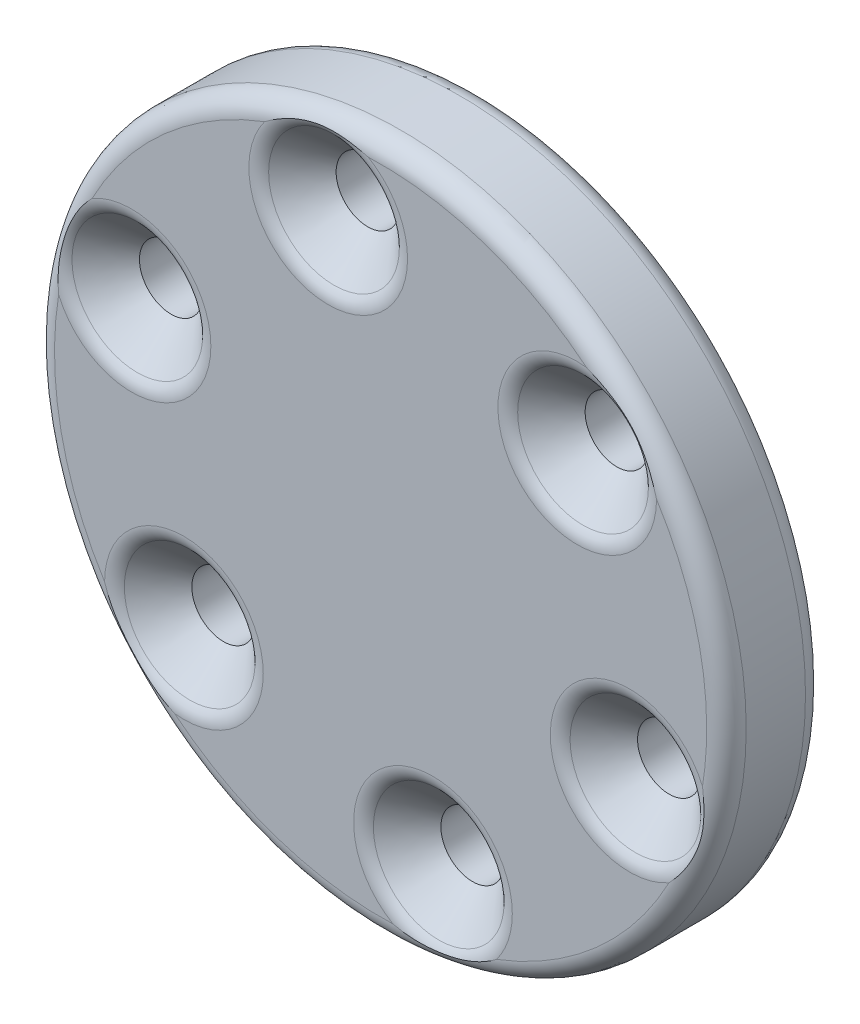
ISO-10303-21;
HEADER;
FILE_DESCRIPTION(('STEP AP214'),'2;1');
FILE_NAME('part.step','',(''),(''),'','','');
FILE_SCHEMA(('AUTOMOTIVE_DESIGN { 1 0 10303 214 1 1 1 1 }'));
ENDSEC;
DATA;
#1=APPLICATION_CONTEXT('core data for automotive mechanical design processes');
#2=APPLICATION_PROTOCOL_DEFINITION('international standard','automotive_design',2000,#1);
#3=PRODUCT_CONTEXT('',#1,'mechanical');
#4=PRODUCT('Part','Part','',(#3));
#5=PRODUCT_RELATED_PRODUCT_CATEGORY('part','',(#4));
#6=PRODUCT_DEFINITION_FORMATION('','',#4);
#7=PRODUCT_DEFINITION_CONTEXT('part definition',#1,'design');
#8=PRODUCT_DEFINITION('design','',#6,#7);
#9=PRODUCT_DEFINITION_SHAPE('','',#8);
#10=(LENGTH_UNIT() NAMED_UNIT(*) SI_UNIT(.MILLI.,.METRE.));
#11=(NAMED_UNIT(*) PLANE_ANGLE_UNIT() SI_UNIT($,.RADIAN.));
#12=(NAMED_UNIT(*) SI_UNIT($,.STERADIAN.) SOLID_ANGLE_UNIT());
#13=UNCERTAINTY_MEASURE_WITH_UNIT(LENGTH_MEASURE(1.E-05),#10,'distance_accuracy_value','');
#14=(GEOMETRIC_REPRESENTATION_CONTEXT(3) GLOBAL_UNCERTAINTY_ASSIGNED_CONTEXT((#13)) GLOBAL_UNIT_ASSIGNED_CONTEXT((#10,
#11,#12)) REPRESENTATION_CONTEXT('',''));
#15=CARTESIAN_POINT('',(0.,0.,0.));
#16=DIRECTION('',(0.,0.,1.));
#17=DIRECTION('',(1.,0.,0.));
#18=AXIS2_PLACEMENT_3D('',#15,#16,#17);
#19=CARTESIAN_POINT('',(-2.65015327966238,13.0205565443838,5.));
#20=DIRECTION('',(0.,0.,-1.));
#21=DIRECTION('',(-1.,0.,0.));
#22=AXIS2_PLACEMENT_3D('',#19,#20,#21);
#23=CYLINDRICAL_SURFACE('',#22,1.6);
#24=CARTESIAN_POINT('',(-2.65015327966238,13.0205565443838,1.));
#25=DIRECTION('',(0.,0.,1.));
#26=DIRECTION('',(1.,0.,0.));
#27=AXIS2_PLACEMENT_3D('',#24,#25,#26);
#28=CIRCLE('',#27,1.6);
#29=CARTESIAN_POINT('',(-1.05015327966238,13.0205565443838,1.));
#30=VERTEX_POINT('',#29);
#31=EDGE_CURVE('E345',#30,#30,#28,.F.);
#32=ORIENTED_EDGE('',*,*,#31,.T.);
#33=EDGE_LOOP('',(#32));
#34=FACE_BOUND('',#33,.T.);
#35=CARTESIAN_POINT('',(-2.65015327966238,13.0205565443838,3.));
#36=DIRECTION('',(0.,0.,1.));
#37=DIRECTION('',(1.,0.,0.));
#38=AXIS2_PLACEMENT_3D('',#35,#36,#37);
#39=CIRCLE('',#38,1.6);
#40=CARTESIAN_POINT('',(-1.05015327966238,13.0205565443838,3.));
#41=VERTEX_POINT('',#40);
#42=EDGE_CURVE('E632',#41,#41,#39,.T.);
#43=ORIENTED_EDGE('',*,*,#42,.T.);
#44=EDGE_LOOP('',(#43));
#45=FACE_BOUND('',#44,.T.);
#46=ADVANCED_FACE('F39',(#34,#45),#23,.F.);
#47=CARTESIAN_POINT('',(9.95105609901738,8.80537833630347,5.));
#48=DIRECTION('',(0.,0.,-1.));
#49=DIRECTION('',(-1.,0.,0.));
#50=AXIS2_PLACEMENT_3D('',#47,#48,#49);
#51=CYLINDRICAL_SURFACE('',#50,1.6);
#52=CARTESIAN_POINT('',(9.95105609901738,8.80537833630347,1.));
#53=DIRECTION('',(0.,0.,1.));
#54=DIRECTION('',(1.,0.,0.));
#55=AXIS2_PLACEMENT_3D('',#52,#53,#54);
#56=CIRCLE('',#55,1.6);
#57=CARTESIAN_POINT('',(11.5510560990174,8.80537833630347,1.));
#58=VERTEX_POINT('',#57);
#59=EDGE_CURVE('E347',#58,#58,#56,.F.);
#60=ORIENTED_EDGE('',*,*,#59,.T.);
#61=EDGE_LOOP('',(#60));
#62=FACE_BOUND('',#61,.T.);
#63=CARTESIAN_POINT('',(9.95105609901738,8.80537833630347,3.));
#64=DIRECTION('',(0.,0.,1.));
#65=DIRECTION('',(1.,0.,0.));
#66=AXIS2_PLACEMENT_3D('',#63,#64,#65);
#67=CIRCLE('',#66,1.6);
#68=CARTESIAN_POINT('',(11.5510560990174,8.80537833630347,3.));
#69=VERTEX_POINT('',#68);
#70=EDGE_CURVE('E634',#69,#69,#67,.T.);
#71=ORIENTED_EDGE('',*,*,#70,.T.);
#72=EDGE_LOOP('',(#71));
#73=FACE_BOUND('',#72,.T.);
#74=ADVANCED_FACE('F237',(#62,#73),#51,.F.);
#75=CARTESIAN_POINT('',(12.6012093786812,-4.21517820808008,5.));
#76=DIRECTION('',(0.,0.,-1.));
#77=DIRECTION('',(-1.,0.,0.));
#78=AXIS2_PLACEMENT_3D('',#75,#76,#77);
#79=CYLINDRICAL_SURFACE('',#78,1.6);
#80=CARTESIAN_POINT('',(12.6012093786812,-4.21517820808008,1.));
#81=DIRECTION('',(0.,0.,1.));
#82=DIRECTION('',(1.,0.,0.));
#83=AXIS2_PLACEMENT_3D('',#80,#81,#82);
#84=CIRCLE('',#83,1.6);
#85=CARTESIAN_POINT('',(14.2012093786812,-4.21517820808008,1.));
#86=VERTEX_POINT('',#85);
#87=EDGE_CURVE('E350',#86,#86,#84,.F.);
#88=ORIENTED_EDGE('',*,*,#87,.T.);
#89=EDGE_LOOP('',(#88));
#90=FACE_BOUND('',#89,.T.);
#91=CARTESIAN_POINT('',(12.6012093786812,-4.21517820808008,3.));
#92=DIRECTION('',(0.,0.,1.));
#93=DIRECTION('',(1.,0.,0.));
#94=AXIS2_PLACEMENT_3D('',#91,#92,#93);
#95=CIRCLE('',#94,1.6);
#96=CARTESIAN_POINT('',(14.2012093786812,-4.21517820808008,3.));
#97=VERTEX_POINT('',#96);
#98=EDGE_CURVE('E367',#97,#97,#95,.T.);
#99=ORIENTED_EDGE('',*,*,#98,.T.);
#100=EDGE_LOOP('',(#99));
#101=FACE_BOUND('',#100,.T.);
#102=ADVANCED_FACE('F243',(#90,#101),#79,.F.);
#103=CARTESIAN_POINT('',(2.65015327966517,-13.0205565443833,5.));
#104=DIRECTION('',(0.,0.,-1.));
#105=DIRECTION('',(-1.,0.,0.));
#106=AXIS2_PLACEMENT_3D('',#103,#104,#105);
#107=CYLINDRICAL_SURFACE('',#106,1.6);
#108=CARTESIAN_POINT('',(2.65015327966517,-13.0205565443833,1.));
#109=DIRECTION('',(0.,0.,1.));
#110=DIRECTION('',(1.,0.,0.));
#111=AXIS2_PLACEMENT_3D('',#108,#109,#110);
#112=CIRCLE('',#111,1.6);
#113=CARTESIAN_POINT('',(4.25015327966517,-13.0205565443833,1.));
#114=VERTEX_POINT('',#113);
#115=EDGE_CURVE('E353',#114,#114,#112,.F.);
#116=ORIENTED_EDGE('',*,*,#115,.T.);
#117=EDGE_LOOP('',(#116));
#118=FACE_BOUND('',#117,.T.);
#119=CARTESIAN_POINT('',(2.65015327966517,-13.0205565443833,3.));
#120=DIRECTION('',(0.,0.,1.));
#121=DIRECTION('',(1.,0.,0.));
#122=AXIS2_PLACEMENT_3D('',#119,#120,#121);
#123=CIRCLE('',#122,1.6);
#124=CARTESIAN_POINT('',(4.25015327966517,-13.0205565443833,3.));
#125=VERTEX_POINT('',#124);
#126=EDGE_CURVE('E361',#125,#125,#123,.T.);
#127=ORIENTED_EDGE('',*,*,#126,.T.);
#128=EDGE_LOOP('',(#127));
#129=FACE_BOUND('',#128,.T.);
#130=ADVANCED_FACE('F254',(#118,#129),#107,.F.);
#131=CARTESIAN_POINT('',(-9.95105609901459,-8.80537833630304,5.));
#132=DIRECTION('',(0.,0.,-1.));
#133=DIRECTION('',(-1.,0.,0.));
#134=AXIS2_PLACEMENT_3D('',#131,#132,#133);
#135=CYLINDRICAL_SURFACE('',#134,1.6);
#136=CARTESIAN_POINT('',(-9.95105609901459,-8.80537833630304,1.));
#137=DIRECTION('',(0.,0.,1.));
#138=DIRECTION('',(1.,0.,0.));
#139=AXIS2_PLACEMENT_3D('',#136,#137,#138);
#140=CIRCLE('',#139,1.6);
#141=CARTESIAN_POINT('',(-8.35105609901459,-8.80537833630304,1.));
#142=VERTEX_POINT('',#141);
#143=EDGE_CURVE('E122',#142,#142,#140,.F.);
#144=ORIENTED_EDGE('',*,*,#143,.T.);
#145=EDGE_LOOP('',(#144));
#146=FACE_BOUND('',#145,.T.);
#147=CARTESIAN_POINT('',(-9.95105609901459,-8.80537833630304,3.));
#148=DIRECTION('',(0.,0.,1.));
#149=DIRECTION('',(1.,0.,0.));
#150=AXIS2_PLACEMENT_3D('',#147,#148,#149);
#151=CIRCLE('',#150,1.6);
#152=CARTESIAN_POINT('',(-8.35105609901459,-8.80537833630304,3.));
#153=VERTEX_POINT('',#152);
#154=EDGE_CURVE('E358',#153,#153,#151,.T.);
#155=ORIENTED_EDGE('',*,*,#154,.T.);
#156=EDGE_LOOP('',(#155));
#157=FACE_BOUND('',#156,.T.);
#158=ADVANCED_FACE('F258',(#146,#157),#135,.F.);
#159=CARTESIAN_POINT('',(-12.6012093786784,4.21517820808051,5.));
#160=DIRECTION('',(0.,0.,-1.));
#161=DIRECTION('',(-1.,0.,0.));
#162=AXIS2_PLACEMENT_3D('',#159,#160,#161);
#163=CYLINDRICAL_SURFACE('',#162,1.6);
#164=CARTESIAN_POINT('',(-12.6012093786784,4.21517820808051,1.));
#165=DIRECTION('',(0.,0.,1.));
#166=DIRECTION('',(1.,0.,0.));
#167=AXIS2_PLACEMENT_3D('',#164,#165,#166);
#168=CIRCLE('',#167,1.6);
#169=CARTESIAN_POINT('',(-11.0012093786784,4.21517820808051,1.));
#170=VERTEX_POINT('',#169);
#171=EDGE_CURVE('E119',#170,#170,#168,.F.);
#172=ORIENTED_EDGE('',*,*,#171,.T.);
#173=EDGE_LOOP('',(#172));
#174=FACE_BOUND('',#173,.T.);
#175=CARTESIAN_POINT('',(-12.6012093786784,4.21517820808051,3.));
#176=DIRECTION('',(0.,0.,1.));
#177=DIRECTION('',(1.,0.,0.));
#178=AXIS2_PLACEMENT_3D('',#175,#176,#177);
#179=CIRCLE('',#178,1.6);
#180=CARTESIAN_POINT('',(-11.0012093786784,4.21517820808051,3.));
#181=VERTEX_POINT('',#180);
#182=EDGE_CURVE('E360',#181,#181,#179,.T.);
#183=ORIENTED_EDGE('',*,*,#182,.T.);
#184=EDGE_LOOP('',(#183));
#185=FACE_BOUND('',#184,.T.);
#186=ADVANCED_FACE('F262',(#174,#185),#163,.F.);
#187=CARTESIAN_POINT('',(0.,0.,5.));
#188=DIRECTION('',(0.,0.,-1.));
#189=DIRECTION('',(-1.,0.,0.));
#190=AXIS2_PLACEMENT_3D('',#187,#188,#189);
#191=CYLINDRICAL_SURFACE('',#190,17.5);
#192=CARTESIAN_POINT('',(0.,0.,1.));
#193=DIRECTION('',(0.,0.,1.));
#194=DIRECTION('',(1.,0.,0.));
#195=AXIS2_PLACEMENT_3D('',#192,#193,#194);
#196=CIRCLE('',#195,17.5);
#197=CARTESIAN_POINT('',(17.5,0.,1.));
#198=VERTEX_POINT('',#197);
#199=EDGE_CURVE('E330',#198,#198,#196,.T.);
#200=ORIENTED_EDGE('',*,*,#199,.T.);
#201=EDGE_LOOP('',(#200));
#202=FACE_BOUND('',#201,.T.);
#203=CARTESIAN_POINT('',(0.,0.,4.));
#204=DIRECTION('',(0.,0.,1.));
#205=DIRECTION('',(1.,0.,0.));
#206=AXIS2_PLACEMENT_3D('',#203,#204,#205);
#207=CIRCLE('',#206,17.5);
#208=CARTESIAN_POINT('',(17.5,0.,4.));
#209=VERTEX_POINT('',#208);
#210=EDGE_CURVE('E364',#209,#209,#207,.F.);
#211=ORIENTED_EDGE('',*,*,#210,.T.);
#212=EDGE_LOOP('',(#211));
#213=FACE_BOUND('',#212,.T.);
#214=ADVANCED_FACE('F249',(#202,#213),#191,.T.);
#215=CARTESIAN_POINT('',(0.,0.,5.));
#216=DIRECTION('',(0.,0.,1.));
#217=DIRECTION('',(1.,0.,0.));
#218=AXIS2_PLACEMENT_3D('',#215,#216,#217);
#219=PLANE('',#218);
#220=CARTESIAN_POINT('',(-9.95105609901459,-8.80537833630304,5.));
#221=DIRECTION('',(0.,0.,1.));
#222=DIRECTION('',(1.,0.,0.));
#223=AXIS2_PLACEMENT_3D('',#220,#221,#222);
#224=CIRCLE('',#223,4.0142135623731);
#225=CARTESIAN_POINT('',(-13.96523039974,-8.78762424561829,5.));
#226=VERTEX_POINT('',#225);
#227=CARTESIAN_POINT('',(-5.93684253664149,-8.80537833630304,5.));
#228=VERTEX_POINT('',#227);
#229=EDGE_CURVE('E65',#226,#228,#224,.F.);
#230=ORIENTED_EDGE('',*,*,#229,.T.);
#231=CARTESIAN_POINT('',(-9.95105609901459,-8.80537833630304,5.));
#232=DIRECTION('',(0.,0.,1.));
#233=DIRECTION('',(1.,0.,0.));
#234=AXIS2_PLACEMENT_3D('',#231,#232,#233);
#235=CIRCLE('',#234,4.0142135623731);
#236=CARTESIAN_POINT('',(-10.4219975750643,-12.7918711119739,5.));
#237=VERTEX_POINT('',#236);
#238=EDGE_CURVE('E60',#228,#237,#235,.F.);
#239=ORIENTED_EDGE('',*,*,#238,.T.);
#240=CARTESIAN_POINT('',(0.,0.,5.));
#241=DIRECTION('',(0.,0.,1.));
#242=DIRECTION('',(1.,0.,0.));
#243=AXIS2_PLACEMENT_3D('',#240,#241,#242);
#244=CIRCLE('',#243,16.5);
#245=CARTESIAN_POINT('',(0.627690635746586,-16.4880564186867,5.));
#246=VERTEX_POINT('',#245);
#247=EDGE_CURVE('E148',#237,#246,#244,.T.);
#248=ORIENTED_EDGE('',*,*,#247,.T.);
#249=CARTESIAN_POINT('',(2.65015327966517,-13.0205565443833,5.));
#250=DIRECTION('',(0.,0.,1.));
#251=DIRECTION('',(1.,0.,0.));
#252=AXIS2_PLACEMENT_3D('',#249,#250,#251);
#253=CIRCLE('',#252,4.0142135623731);
#254=CARTESIAN_POINT('',(6.66436684203827,-13.0205565443833,5.));
#255=VERTEX_POINT('',#254);
#256=EDGE_CURVE('E145',#246,#255,#253,.F.);
#257=ORIENTED_EDGE('',*,*,#256,.T.);
#258=CARTESIAN_POINT('',(2.65015327966517,-13.0205565443833,5.));
#259=DIRECTION('',(0.,0.,1.));
#260=DIRECTION('',(1.,0.,0.));
#261=AXIS2_PLACEMENT_3D('',#258,#259,#260);
#262=CIRCLE('',#261,4.0142135623731);
#263=CARTESIAN_POINT('',(5.86708655737593,-15.4216502141716,5.));
#264=VERTEX_POINT('',#263);
#265=EDGE_CURVE('E143',#255,#264,#262,.F.);
#266=ORIENTED_EDGE('',*,*,#265,.T.);
#267=CARTESIAN_POINT('',(0.,0.,5.));
#268=DIRECTION('',(0.,0.,1.));
#269=DIRECTION('',(1.,0.,0.));
#270=AXIS2_PLACEMENT_3D('',#267,#268,#269);
#271=CIRCLE('',#270,16.5);
#272=CARTESIAN_POINT('',(14.5929210354858,-7.70043217307151,5.));
#273=VERTEX_POINT('',#272);
#274=EDGE_CURVE('E139',#264,#273,#271,.T.);
#275=ORIENTED_EDGE('',*,*,#274,.T.);
#276=CARTESIAN_POINT('',(12.6012093786812,-4.21517820808008,5.));
#277=DIRECTION('',(0.,0.,1.));
#278=DIRECTION('',(1.,0.,0.));
#279=AXIS2_PLACEMENT_3D('',#276,#277,#278);
#280=CIRCLE('',#279,4.0142135623731);
#281=CARTESIAN_POINT('',(16.2890841324384,-2.62977910219536,5.));
#282=VERTEX_POINT('',#281);
#283=EDGE_CURVE('E135',#273,#282,#280,.F.);
#284=ORIENTED_EDGE('',*,*,#283,.T.);
#285=CARTESIAN_POINT('',(0.,0.,5.));
#286=DIRECTION('',(0.,0.,1.));
#287=DIRECTION('',(1.,0.,0.));
#288=AXIS2_PLACEMENT_3D('',#285,#286,#287);
#289=CIRCLE('',#288,16.5);
#290=CARTESIAN_POINT('',(13.9652303997427,8.78762424561389,5.));
#291=VERTEX_POINT('',#290);
#292=EDGE_CURVE('E133',#282,#291,#289,.T.);
#293=ORIENTED_EDGE('',*,*,#292,.T.);
#294=CARTESIAN_POINT('',(9.95105609901738,8.80537833630347,5.));
#295=DIRECTION('',(0.,0.,1.));
#296=DIRECTION('',(1.,0.,0.));
#297=AXIS2_PLACEMENT_3D('',#294,#295,#296);
#298=CIRCLE('',#297,4.0142135623731);
#299=CARTESIAN_POINT('',(10.4219975750632,12.7918711119748,5.));
#300=VERTEX_POINT('',#299);
#301=EDGE_CURVE('E129',#291,#300,#298,.F.);
#302=ORIENTED_EDGE('',*,*,#301,.T.);
#303=CARTESIAN_POINT('',(0.,0.,5.));
#304=DIRECTION('',(0.,0.,1.));
#305=DIRECTION('',(1.,0.,0.));
#306=AXIS2_PLACEMENT_3D('',#303,#304,#305);
#307=CIRCLE('',#306,16.5);
#308=CARTESIAN_POINT('',(-0.627690635743248,16.4880564186868,5.));
#309=VERTEX_POINT('',#308);
#310=EDGE_CURVE('E113',#300,#309,#307,.T.);
#311=ORIENTED_EDGE('',*,*,#310,.T.);
#312=CARTESIAN_POINT('',(-2.65015327966238,13.0205565443838,5.));
#313=DIRECTION('',(0.,0.,1.));
#314=DIRECTION('',(1.,0.,0.));
#315=AXIS2_PLACEMENT_3D('',#312,#313,#314);
#316=CIRCLE('',#315,4.0142135623731);
#317=CARTESIAN_POINT('',(1.36406028271072,13.0205565443838,5.));
#318=VERTEX_POINT('',#317);
#319=EDGE_CURVE('E106',#309,#318,#316,.F.);
#320=ORIENTED_EDGE('',*,*,#319,.T.);
#321=CARTESIAN_POINT('',(-2.65015327966238,13.0205565443838,5.));
#322=DIRECTION('',(0.,0.,1.));
#323=DIRECTION('',(1.,0.,0.));
#324=AXIS2_PLACEMENT_3D('',#321,#322,#323);
#325=CIRCLE('',#324,4.0142135623731);
#326=CARTESIAN_POINT('',(-5.8670865573725,15.4216502141729,5.));
#327=VERTEX_POINT('',#326);
#328=EDGE_CURVE('E110',#318,#327,#325,.F.);
#329=ORIENTED_EDGE('',*,*,#328,.T.);
#330=CARTESIAN_POINT('',(0.,0.,5.));
#331=DIRECTION('',(0.,0.,1.));
#332=DIRECTION('',(1.,0.,0.));
#333=AXIS2_PLACEMENT_3D('',#330,#331,#332);
#334=CIRCLE('',#333,16.5);
#335=CARTESIAN_POINT('',(-14.5929210354867,7.70043217306982,5.));
#336=VERTEX_POINT('',#335);
#337=EDGE_CURVE('E127',#327,#336,#334,.T.);
#338=ORIENTED_EDGE('',*,*,#337,.T.);
#339=CARTESIAN_POINT('',(-12.6012093786784,4.21517820808051,5.));
#340=DIRECTION('',(0.,0.,1.));
#341=DIRECTION('',(1.,0.,0.));
#342=AXIS2_PLACEMENT_3D('',#339,#340,#341);
#343=CIRCLE('',#342,4.0142135623731);
#344=CARTESIAN_POINT('',(-8.58699581630528,4.21517820808051,5.));
#345=VERTEX_POINT('',#344);
#346=EDGE_CURVE('E131',#336,#345,#343,.F.);
#347=ORIENTED_EDGE('',*,*,#346,.T.);
#348=CARTESIAN_POINT('',(-12.6012093786784,4.21517820808051,5.));
#349=DIRECTION('',(0.,0.,1.));
#350=DIRECTION('',(1.,0.,0.));
#351=AXIS2_PLACEMENT_3D('',#348,#349,#350);
#352=CIRCLE('',#351,4.0142135623731);
#353=CARTESIAN_POINT('',(-16.2890841324376,2.62977910220041,5.));
#354=VERTEX_POINT('',#353);
#355=EDGE_CURVE('E137',#345,#354,#352,.F.);
#356=ORIENTED_EDGE('',*,*,#355,.T.);
#357=CARTESIAN_POINT('',(0.,0.,5.));
#358=DIRECTION('',(0.,0.,1.));
#359=DIRECTION('',(1.,0.,0.));
#360=AXIS2_PLACEMENT_3D('',#357,#358,#359);
#361=CIRCLE('',#360,16.5);
#362=EDGE_CURVE('E141',#354,#226,#361,.T.);
#363=ORIENTED_EDGE('',*,*,#362,.T.);
#364=EDGE_LOOP('',(#230,#239,#248,#257,#266,#275,#284,#293,#302,#311,#320,#329,#338,#347,#356,#363));
#365=FACE_BOUND('',#364,.T.);
#366=ADVANCED_FACE('F108',(#365),#219,.T.);
#367=CARTESIAN_POINT('',(0.,0.,0.));
#368=DIRECTION('',(0.,0.,1.));
#369=DIRECTION('',(1.,0.,0.));
#370=AXIS2_PLACEMENT_3D('',#367,#368,#369);
#371=PLANE('',#370);
#372=CARTESIAN_POINT('',(0.,0.,0.));
#373=DIRECTION('',(0.,0.,1.));
#374=DIRECTION('',(1.,0.,0.));
#375=AXIS2_PLACEMENT_3D('',#372,#373,#374);
#376=CIRCLE('',#375,16.5);
#377=CARTESIAN_POINT('',(16.5,0.,0.));
#378=VERTEX_POINT('',#377);
#379=EDGE_CURVE('E342',#378,#378,#376,.F.);
#380=ORIENTED_EDGE('',*,*,#379,.T.);
#381=EDGE_LOOP('',(#380));
#382=FACE_BOUND('',#381,.T.);
#383=CARTESIAN_POINT('',(-2.65015327966238,13.0205565443838,0.));
#384=DIRECTION('',(0.,0.,1.));
#385=DIRECTION('',(1.,0.,0.));
#386=AXIS2_PLACEMENT_3D('',#383,#384,#385);
#387=CIRCLE('',#386,2.6);
#388=CARTESIAN_POINT('',(-0.0501532796623808,13.0205565443838,0.));
#389=VERTEX_POINT('',#388);
#390=EDGE_CURVE('E339',#389,#389,#387,.T.);
#391=ORIENTED_EDGE('',*,*,#390,.T.);
#392=EDGE_LOOP('',(#391));
#393=FACE_BOUND('',#392,.T.);
#394=CARTESIAN_POINT('',(9.95105609901738,8.80537833630347,0.));
#395=DIRECTION('',(0.,0.,1.));
#396=DIRECTION('',(1.,0.,0.));
#397=AXIS2_PLACEMENT_3D('',#394,#395,#396);
#398=CIRCLE('',#397,2.6);
#399=CARTESIAN_POINT('',(12.5510560990174,8.80537833630347,0.));
#400=VERTEX_POINT('',#399);
#401=EDGE_CURVE('E336',#400,#400,#398,.T.);
#402=ORIENTED_EDGE('',*,*,#401,.T.);
#403=EDGE_LOOP('',(#402));
#404=FACE_BOUND('',#403,.T.);
#405=CARTESIAN_POINT('',(12.6012093786812,-4.21517820808008,0.));
#406=DIRECTION('',(0.,0.,1.));
#407=DIRECTION('',(1.,0.,0.));
#408=AXIS2_PLACEMENT_3D('',#405,#406,#407);
#409=CIRCLE('',#408,2.6);
#410=CARTESIAN_POINT('',(15.2012093786812,-4.21517820808008,0.));
#411=VERTEX_POINT('',#410);
#412=EDGE_CURVE('E327',#411,#411,#409,.T.);
#413=ORIENTED_EDGE('',*,*,#412,.T.);
#414=EDGE_LOOP('',(#413));
#415=FACE_BOUND('',#414,.T.);
#416=CARTESIAN_POINT('',(2.65015327966517,-13.0205565443833,0.));
#417=DIRECTION('',(0.,0.,1.));
#418=DIRECTION('',(1.,0.,0.));
#419=AXIS2_PLACEMENT_3D('',#416,#417,#418);
#420=CIRCLE('',#419,2.6);
#421=CARTESIAN_POINT('',(5.25015327966517,-13.0205565443833,0.));
#422=VERTEX_POINT('',#421);
#423=EDGE_CURVE('E323',#422,#422,#420,.T.);
#424=ORIENTED_EDGE('',*,*,#423,.T.);
#425=EDGE_LOOP('',(#424));
#426=FACE_BOUND('',#425,.T.);
#427=CARTESIAN_POINT('',(-9.95105609901459,-8.80537833630304,0.));
#428=DIRECTION('',(0.,0.,1.));
#429=DIRECTION('',(1.,0.,0.));
#430=AXIS2_PLACEMENT_3D('',#427,#428,#429);
#431=CIRCLE('',#430,2.6);
#432=CARTESIAN_POINT('',(-7.35105609901459,-8.80537833630304,0.));
#433=VERTEX_POINT('',#432);
#434=EDGE_CURVE('E321',#433,#433,#431,.T.);
#435=ORIENTED_EDGE('',*,*,#434,.T.);
#436=EDGE_LOOP('',(#435));
#437=FACE_BOUND('',#436,.T.);
#438=CARTESIAN_POINT('',(-12.6012093786784,4.21517820808051,0.));
#439=DIRECTION('',(0.,0.,1.));
#440=DIRECTION('',(1.,0.,0.));
#441=AXIS2_PLACEMENT_3D('',#438,#439,#440);
#442=CIRCLE('',#441,2.6);
#443=CARTESIAN_POINT('',(-10.0012093786784,4.21517820808051,0.));
#444=VERTEX_POINT('',#443);
#445=EDGE_CURVE('E324',#444,#444,#442,.T.);
#446=ORIENTED_EDGE('',*,*,#445,.T.);
#447=EDGE_LOOP('',(#446));
#448=FACE_BOUND('',#447,.T.);
#449=ADVANCED_FACE('F271',(#382,#393,#404,#415,#426,#437,#448),#371,.F.);
#450=CARTESIAN_POINT('',(-2.65015327966238,13.0205565443838,3.));
#451=DIRECTION('',(0.,0.,1.));
#452=DIRECTION('',(1.,0.,0.));
#453=AXIS2_PLACEMENT_3D('',#450,#451,#452);
#454=CONICAL_SURFACE('',#453,1.6,0.785398163397449);
#455=CARTESIAN_POINT('',(-2.65015327966238,13.0205565443838,4.70710678118655));
#456=DIRECTION('',(0.,0.,-1.));
#457=DIRECTION('',(-1.,0.,0.));
#458=AXIS2_PLACEMENT_3D('',#455,#456,#457);
#459=CIRCLE('',#458,3.30710678118655);
#460=CARTESIAN_POINT('',(-5.95726006084894,13.0205565443838,4.70710678118655));
#461=VERTEX_POINT('',#460);
#462=EDGE_CURVE('E11',#461,#461,#459,.F.);
#463=ORIENTED_EDGE('',*,*,#462,.T.);
#464=EDGE_LOOP('',(#463));
#465=FACE_BOUND('',#464,.T.);
#466=ORIENTED_EDGE('',*,*,#42,.F.);
#467=EDGE_LOOP('',(#466));
#468=FACE_BOUND('',#467,.T.);
#469=ADVANCED_FACE('F267',(#465,#468),#454,.F.);
#470=CARTESIAN_POINT('',(9.95105609901738,8.80537833630347,3.));
#471=DIRECTION('',(0.,0.,1.));
#472=DIRECTION('',(1.,0.,0.));
#473=AXIS2_PLACEMENT_3D('',#470,#471,#472);
#474=CONICAL_SURFACE('',#473,1.6,0.785398163397449);
#475=CARTESIAN_POINT('',(9.95105609901738,8.80537833630347,4.70710678118655));
#476=DIRECTION('',(0.,0.,-1.));
#477=DIRECTION('',(-1.,0.,0.));
#478=AXIS2_PLACEMENT_3D('',#475,#476,#477);
#479=CIRCLE('',#478,3.30710678118655);
#480=CARTESIAN_POINT('',(6.64394931783083,8.80537833630347,4.70710678118655));
#481=VERTEX_POINT('',#480);
#482=EDGE_CURVE('E52',#481,#481,#479,.F.);
#483=ORIENTED_EDGE('',*,*,#482,.T.);
#484=EDGE_LOOP('',(#483));
#485=FACE_BOUND('',#484,.T.);
#486=ORIENTED_EDGE('',*,*,#70,.F.);
#487=EDGE_LOOP('',(#486));
#488=FACE_BOUND('',#487,.T.);
#489=ADVANCED_FACE('F270',(#485,#488),#474,.F.);
#490=CARTESIAN_POINT('',(12.6012093786812,-4.21517820808008,3.));
#491=DIRECTION('',(0.,0.,1.));
#492=DIRECTION('',(1.,0.,0.));
#493=AXIS2_PLACEMENT_3D('',#490,#491,#492);
#494=CONICAL_SURFACE('',#493,1.6,0.785398163397448);
#495=CARTESIAN_POINT('',(12.6012093786812,-4.21517820808008,4.70710678118655));
#496=DIRECTION('',(0.,0.,-1.));
#497=DIRECTION('',(-1.,0.,0.));
#498=AXIS2_PLACEMENT_3D('',#495,#496,#497);
#499=CIRCLE('',#498,3.30710678118655);
#500=CARTESIAN_POINT('',(9.29410259749461,-4.21517820808008,4.70710678118655));
#501=VERTEX_POINT('',#500);
#502=EDGE_CURVE('E160',#501,#501,#499,.F.);
#503=ORIENTED_EDGE('',*,*,#502,.T.);
#504=EDGE_LOOP('',(#503));
#505=FACE_BOUND('',#504,.T.);
#506=ORIENTED_EDGE('',*,*,#98,.F.);
#507=EDGE_LOOP('',(#506));
#508=FACE_BOUND('',#507,.T.);
#509=ADVANCED_FACE('F275',(#505,#508),#494,.F.);
#510=CARTESIAN_POINT('',(2.65015327966517,-13.0205565443833,3.));
#511=DIRECTION('',(0.,0.,1.));
#512=DIRECTION('',(1.,0.,0.));
#513=AXIS2_PLACEMENT_3D('',#510,#511,#512);
#514=CONICAL_SURFACE('',#513,1.6,0.785398163397449);
#515=CARTESIAN_POINT('',(2.65015327966517,-13.0205565443833,4.70710678118655));
#516=DIRECTION('',(0.,0.,-1.));
#517=DIRECTION('',(-1.,0.,0.));
#518=AXIS2_PLACEMENT_3D('',#515,#516,#517);
#519=CIRCLE('',#518,3.30710678118655);
#520=CARTESIAN_POINT('',(-0.656953501521382,-13.0205565443833,4.70710678118655));
#521=VERTEX_POINT('',#520);
#522=EDGE_CURVE('E157',#521,#521,#519,.F.);
#523=ORIENTED_EDGE('',*,*,#522,.T.);
#524=EDGE_LOOP('',(#523));
#525=FACE_BOUND('',#524,.T.);
#526=ORIENTED_EDGE('',*,*,#126,.F.);
#527=EDGE_LOOP('',(#526));
#528=FACE_BOUND('',#527,.T.);
#529=ADVANCED_FACE('F279',(#525,#528),#514,.F.);
#530=CARTESIAN_POINT('',(-9.95105609901459,-8.80537833630304,3.));
#531=DIRECTION('',(0.,0.,1.));
#532=DIRECTION('',(1.,0.,0.));
#533=AXIS2_PLACEMENT_3D('',#530,#531,#532);
#534=CONICAL_SURFACE('',#533,1.6,0.785398163397449);
#535=CARTESIAN_POINT('',(-9.95105609901459,-8.80537833630304,4.70710678118655));
#536=DIRECTION('',(0.,0.,-1.));
#537=DIRECTION('',(-1.,0.,0.));
#538=AXIS2_PLACEMENT_3D('',#535,#536,#537);
#539=CIRCLE('',#538,3.30710678118655);
#540=CARTESIAN_POINT('',(-13.2581628802011,-8.80537833630304,4.70710678118655));
#541=VERTEX_POINT('',#540);
#542=EDGE_CURVE('E154',#541,#541,#539,.F.);
#543=ORIENTED_EDGE('',*,*,#542,.T.);
#544=EDGE_LOOP('',(#543));
#545=FACE_BOUND('',#544,.T.);
#546=ORIENTED_EDGE('',*,*,#154,.F.);
#547=EDGE_LOOP('',(#546));
#548=FACE_BOUND('',#547,.T.);
#549=ADVANCED_FACE('F283',(#545,#548),#534,.F.);
#550=CARTESIAN_POINT('',(-12.6012093786784,4.21517820808051,3.));
#551=DIRECTION('',(0.,0.,1.));
#552=DIRECTION('',(1.,0.,0.));
#553=AXIS2_PLACEMENT_3D('',#550,#551,#552);
#554=CONICAL_SURFACE('',#553,1.6,0.785398163397448);
#555=CARTESIAN_POINT('',(-12.6012093786784,4.21517820808051,4.70710678118655));
#556=DIRECTION('',(0.,0.,-1.));
#557=DIRECTION('',(-1.,0.,0.));
#558=AXIS2_PLACEMENT_3D('',#555,#556,#557);
#559=CIRCLE('',#558,3.30710678118655);
#560=CARTESIAN_POINT('',(-15.9083161598649,4.21517820808051,4.70710678118655));
#561=VERTEX_POINT('',#560);
#562=EDGE_CURVE('E151',#561,#561,#559,.F.);
#563=ORIENTED_EDGE('',*,*,#562,.T.);
#564=EDGE_LOOP('',(#563));
#565=FACE_BOUND('',#564,.T.);
#566=ORIENTED_EDGE('',*,*,#182,.F.);
#567=EDGE_LOOP('',(#566));
#568=FACE_BOUND('',#567,.T.);
#569=ADVANCED_FACE('F287',(#565,#568),#554,.F.);
#570=CARTESIAN_POINT('',(0.,0.,1.));
#571=DIRECTION('',(0.,0.,1.));
#572=DIRECTION('',(1.,0.,0.));
#573=AXIS2_PLACEMENT_3D('',#570,#571,#572);
#574=TOROIDAL_SURFACE('',#573,16.5,1.);
#575=ORIENTED_EDGE('',*,*,#379,.F.);
#576=EDGE_LOOP('',(#575));
#577=FACE_BOUND('',#576,.T.);
#578=ORIENTED_EDGE('',*,*,#199,.F.);
#579=EDGE_LOOP('',(#578));
#580=FACE_BOUND('',#579,.T.);
#581=ADVANCED_FACE('F291',(#577,#580),#574,.T.);
#582=CARTESIAN_POINT('',(-2.65015327966238,13.0205565443838,1.));
#583=DIRECTION('',(0.,0.,1.));
#584=DIRECTION('',(1.,0.,0.));
#585=AXIS2_PLACEMENT_3D('',#582,#583,#584);
#586=TOROIDAL_SURFACE('',#585,2.6,1.);
#587=ORIENTED_EDGE('',*,*,#31,.F.);
#588=EDGE_LOOP('',(#587));
#589=FACE_BOUND('',#588,.T.);
#590=ORIENTED_EDGE('',*,*,#390,.F.);
#591=EDGE_LOOP('',(#590));
#592=FACE_BOUND('',#591,.T.);
#593=ADVANCED_FACE('F295',(#589,#592),#586,.T.);
#594=CARTESIAN_POINT('',(9.95105609901738,8.80537833630347,1.));
#595=DIRECTION('',(0.,0.,1.));
#596=DIRECTION('',(1.,0.,0.));
#597=AXIS2_PLACEMENT_3D('',#594,#595,#596);
#598=TOROIDAL_SURFACE('',#597,2.6,1.);
#599=ORIENTED_EDGE('',*,*,#59,.F.);
#600=EDGE_LOOP('',(#599));
#601=FACE_BOUND('',#600,.T.);
#602=ORIENTED_EDGE('',*,*,#401,.F.);
#603=EDGE_LOOP('',(#602));
#604=FACE_BOUND('',#603,.T.);
#605=ADVANCED_FACE('F299',(#601,#604),#598,.T.);
#606=CARTESIAN_POINT('',(12.6012093786812,-4.21517820808008,1.));
#607=DIRECTION('',(0.,0.,1.));
#608=DIRECTION('',(1.,0.,0.));
#609=AXIS2_PLACEMENT_3D('',#606,#607,#608);
#610=TOROIDAL_SURFACE('',#609,2.6,1.);
#611=ORIENTED_EDGE('',*,*,#87,.F.);
#612=EDGE_LOOP('',(#611));
#613=FACE_BOUND('',#612,.T.);
#614=ORIENTED_EDGE('',*,*,#412,.F.);
#615=EDGE_LOOP('',(#614));
#616=FACE_BOUND('',#615,.T.);
#617=ADVANCED_FACE('F303',(#613,#616),#610,.T.);
#618=CARTESIAN_POINT('',(2.65015327966517,-13.0205565443833,1.));
#619=DIRECTION('',(0.,0.,1.));
#620=DIRECTION('',(1.,0.,0.));
#621=AXIS2_PLACEMENT_3D('',#618,#619,#620);
#622=TOROIDAL_SURFACE('',#621,2.6,1.);
#623=ORIENTED_EDGE('',*,*,#115,.F.);
#624=EDGE_LOOP('',(#623));
#625=FACE_BOUND('',#624,.T.);
#626=ORIENTED_EDGE('',*,*,#423,.F.);
#627=EDGE_LOOP('',(#626));
#628=FACE_BOUND('',#627,.T.);
#629=ADVANCED_FACE('F307',(#625,#628),#622,.T.);
#630=CARTESIAN_POINT('',(-9.95105609901459,-8.80537833630304,1.));
#631=DIRECTION('',(0.,0.,1.));
#632=DIRECTION('',(1.,0.,0.));
#633=AXIS2_PLACEMENT_3D('',#630,#631,#632);
#634=TOROIDAL_SURFACE('',#633,2.6,1.);
#635=ORIENTED_EDGE('',*,*,#143,.F.);
#636=EDGE_LOOP('',(#635));
#637=FACE_BOUND('',#636,.T.);
#638=ORIENTED_EDGE('',*,*,#434,.F.);
#639=EDGE_LOOP('',(#638));
#640=FACE_BOUND('',#639,.T.);
#641=ADVANCED_FACE('F233',(#637,#640),#634,.T.);
#642=CARTESIAN_POINT('',(-12.6012093786784,4.21517820808051,1.));
#643=DIRECTION('',(0.,0.,1.));
#644=DIRECTION('',(1.,0.,0.));
#645=AXIS2_PLACEMENT_3D('',#642,#643,#644);
#646=TOROIDAL_SURFACE('',#645,2.6,1.);
#647=ORIENTED_EDGE('',*,*,#171,.F.);
#648=EDGE_LOOP('',(#647));
#649=FACE_BOUND('',#648,.T.);
#650=ORIENTED_EDGE('',*,*,#445,.F.);
#651=EDGE_LOOP('',(#650));
#652=FACE_BOUND('',#651,.T.);
#653=ADVANCED_FACE('F227',(#649,#652),#646,.T.);
#654=CARTESIAN_POINT('',(-2.65015327966238,13.0205565443838,4.));
#655=DIRECTION('',(0.,0.,1.));
#656=DIRECTION('',(1.,0.,0.));
#657=AXIS2_PLACEMENT_3D('',#654,#655,#656);
#658=TOROIDAL_SURFACE('',#657,4.0142135623731,1.);
#659=ORIENTED_EDGE('',*,*,#462,.F.);
#660=EDGE_LOOP('',(#659));
#661=FACE_BOUND('',#660,.T.);
#662=ORIENTED_EDGE('',*,*,#328,.F.);
#663=ORIENTED_EDGE('',*,*,#319,.F.);
#664=CARTESIAN_POINT('',(-0.627690635743256,16.4880564186868,5.00000000000001));
#665=CARTESIAN_POINT('',(-0.630483357944817,16.4887546221146,4.99999999496241));
#666=CARTESIAN_POINT('',(-0.63327655033944,16.4894510345053,4.99999902567045));
#667=CARTESIAN_POINT('',(-0.800381147444526,16.5310001610585,4.99988380228398));
#668=CARTESIAN_POINT('',(-0.966308462622403,16.5656526938622,4.99645991685647));
#669=CARTESIAN_POINT('',(-1.30033406227146,16.6218382926356,4.98593220326691));
#670=CARTESIAN_POINT('',(-1.46843396503105,16.643360925805,4.9788254570352));
#671=CARTESIAN_POINT('',(-1.80616961337385,16.6727578098223,4.96354289300826));
#672=CARTESIAN_POINT('',(-1.97580793864603,16.680601679875,4.95536473876258));
#673=CARTESIAN_POINT('',(-2.31516871677905,16.6821406552161,4.94029466141036));
#674=CARTESIAN_POINT('',(-2.48489113253361,16.6758397413298,4.93340237700742));
#675=CARTESIAN_POINT('',(-2.82369108421707,16.6488397513169,4.92271979455607));
#676=CARTESIAN_POINT('',(-2.99276627055931,16.6281079107728,4.91893659818452));
#677=CARTESIAN_POINT('',(-3.32857877125074,16.5722232353288,4.91550172408997));
#678=CARTESIAN_POINT('',(-3.49531588603569,16.5370691770874,4.9158503969161));
#679=CARTESIAN_POINT('',(-3.8249867128348,16.4526646375878,4.92058614841053));
#680=CARTESIAN_POINT('',(-3.98792314615661,16.4034245993544,4.92497024063101));
#681=CARTESIAN_POINT('',(-4.30889952460265,16.2913863957468,4.93660836512742));
#682=CARTESIAN_POINT('',(-4.46694045104232,16.2285909679565,4.94386181816638));
#683=CARTESIAN_POINT('',(-4.81366672431785,16.0738509864973,4.96111983678677));
#684=CARTESIAN_POINT('',(-5.00083361999336,15.9785242015728,4.97137046114723));
#685=CARTESIAN_POINT('',(-5.36465309715247,15.7698493155111,4.98870104727436));
#686=CARTESIAN_POINT('',(-5.54132167658005,15.6565296538972,4.99578594648221));
#687=CARTESIAN_POINT('',(-5.76202204675476,15.499706997849,4.99948101632031));
#688=CARTESIAN_POINT('',(-5.81135734401293,15.4636121450658,4.99995606091975));
#689=CARTESIAN_POINT('',(-5.86249016770068,15.4251171861677,4.99999903214848));
#690=CARTESIAN_POINT('',(-5.86478886953667,15.4233843040018,5.00000000225762));
#691=CARTESIAN_POINT('',(-5.86708645632085,15.4216499407206,5.00000000193267));
#692=B_SPLINE_CURVE_WITH_KNOTS('',3,(#664,#665,#666,#667,#668,#669,#670,#671,#672,#673,#674,
#675,#676,#677,#678,#679,#680,#681,#682,#683,#684,#685,#686,#687,#688,#689,#690,#691),
.UNSPECIFIED.,.F.,.F.,(4,2,2,2,2,2,2,2,2,2,2,2,2,4),(0.,0.00863609734735337,0.516573866236208,
1.02491471013523,1.53438315765943,2.04370824133685,2.55419350024899,3.06472206920703,
3.57487312048778,4.08492124024323,4.71473802773347,5.34356905958262,5.52694312292643,
5.53557921984481),.UNSPECIFIED.);
#693=EDGE_CURVE('E43',#327,#309,#692,.F.);
#694=ORIENTED_EDGE('',*,*,#693,.F.);
#695=EDGE_LOOP('',(#662,#663,#694));
#696=FACE_BOUND('',#695,.T.);
#697=ADVANCED_FACE('F117',(#661,#696),#658,.T.);
#698=CARTESIAN_POINT('',(-12.6012093786784,4.21517820808051,4.));
#699=DIRECTION('',(0.,0.,1.));
#700=DIRECTION('',(1.,0.,0.));
#701=AXIS2_PLACEMENT_3D('',#698,#699,#700);
#702=TOROIDAL_SURFACE('',#701,4.0142135623731,1.);
#703=ORIENTED_EDGE('',*,*,#562,.F.);
#704=EDGE_LOOP('',(#703));
#705=FACE_BOUND('',#704,.T.);
#706=ORIENTED_EDGE('',*,*,#355,.F.);
#707=ORIENTED_EDGE('',*,*,#346,.F.);
#708=CARTESIAN_POINT('',(-14.5929210354867,7.70043217306984,5.00000000000115));
#709=CARTESIAN_POINT('',(-14.594922058493,7.69836270641145,4.99999999496316));
#710=CARTESIAN_POINT('',(-14.5969217655121,7.6962919370354,4.99999902567082));
#711=CARTESIAN_POINT('',(-14.7164566841242,7.57234965239725,4.99988380224206));
#712=CARTESIAN_POINT('',(-14.8294303347508,7.44597862533008,4.99645991563436));
#713=CARTESIAN_POINT('',(-15.045101326035,7.18479671937753,4.98593219881897));
#714=CARTESIAN_POINT('',(-15.1477904406905,7.04997922255201,4.97882545051499));
#715=CARTESIAN_POINT('',(-15.3421167066848,6.77219000511154,4.96354288555712));
#716=CARTESIAN_POINT('',(-15.4337288413024,6.62920086279223,4.95536473282608));
#717=CARTESIAN_POINT('',(-15.6047419866499,6.33607534589637,4.94029465869716));
#718=CARTESIAN_POINT('',(-15.6841464266787,6.18594099407757,4.93340237596524));
#719=CARTESIAN_POINT('',(-15.8301636685464,5.87903175069431,4.92271979755609));
#720=CARTESIAN_POINT('',(-15.8967469255396,5.72224251404006,4.91893660240909));
#721=CARTESIAN_POINT('',(-16.0162555854526,5.40347819081749,4.91550172551592));
#722=CARTESIAN_POINT('',(-16.0691798280013,5.24150266497256,4.9158503946651));
#723=CARTESIAN_POINT('',(-16.1609187831181,4.91379707104486,4.92058613848084));
#724=CARTESIAN_POINT('',(-16.1997438848167,4.74806986349116,4.92497023113982));
#725=CARTESIAN_POINT('',(-16.2632042581356,4.41407688367928,4.93660835882101));
#726=CARTESIAN_POINT('',(-16.2878423941064,4.24581163089797,4.94386181401924));
#727=CARTESIAN_POINT('',(-16.3271965044886,3.8681677292389,4.96111984318012));
#728=CARTESIAN_POINT('',(-16.3382240309611,3.65841299590811,4.97137047715584));
#729=CARTESIAN_POINT('',(-16.3394173225434,3.23899847972286,4.98870105042528));
#730=CARTESIAN_POINT('',(-16.3296157353056,3.02933906270896,4.99578593066891));
#731=CARTESIAN_POINT('',(-16.3041503105262,2.75979614664356,4.99948102100872));
#732=CARTESIAN_POINT('',(-16.2975578087971,2.69902326199546,4.99995607318756));
#733=CARTESIAN_POINT('',(-16.289788519449,2.63549325144528,4.99999903151246));
#734=CARTESIAN_POINT('',(-16.2894372426434,2.63263606468871,5.00000000099704));
#735=CARTESIAN_POINT('',(-16.2890841324376,2.62977910220039,5.));
#736=B_SPLINE_CURVE_WITH_KNOTS('',3,(#708,#709,#710,#711,#712,#713,#714,#715,#716,#717,#718,
#719,#720,#721,#722,#723,#724,#725,#726,#727,#728,#729,#730,#731,#732,#733,#734,#735),
.UNSPECIFIED.,.F.,.F.,(4,2,2,2,2,2,2,2,2,2,2,2,2,4),(0.,0.00863609734736057,0.51657395681386,
1.02491489495003,1.53438325752952,2.0437082413419,2.55419321351886,3.06472153854406,
3.5748729072971,4.08492124026505,4.71473837503353,5.34356905959991,5.5269430386105,
5.53557913595786),.UNSPECIFIED.);
#737=EDGE_CURVE('E209',#354,#336,#736,.F.);
#738=ORIENTED_EDGE('',*,*,#737,.F.);
#739=EDGE_LOOP('',(#706,#707,#738));
#740=FACE_BOUND('',#739,.T.);
#741=ADVANCED_FACE('F219',(#705,#740),#702,.T.);
#742=CARTESIAN_POINT('',(-9.95105609901459,-8.80537833630304,4.));
#743=DIRECTION('',(0.,0.,1.));
#744=DIRECTION('',(1.,0.,0.));
#745=AXIS2_PLACEMENT_3D('',#742,#743,#744);
#746=TOROIDAL_SURFACE('',#745,4.0142135623731,1.);
#747=ORIENTED_EDGE('',*,*,#542,.F.);
#748=EDGE_LOOP('',(#747));
#749=FACE_BOUND('',#748,.T.);
#750=ORIENTED_EDGE('',*,*,#238,.F.);
#751=ORIENTED_EDGE('',*,*,#229,.F.);
#752=CARTESIAN_POINT('',(-10.4219975750643,-12.7918711119739,5.));
#753=CARTESIAN_POINT('',(-10.4246483122056,-12.7907484464272,4.99999999496241));
#754=CARTESIAN_POINT('',(-10.4272983472624,-12.7896240674125,4.99999902567045));
#755=CARTESIAN_POINT('',(-10.5857697709797,-12.7222661090576,4.99988380226399));
#756=CARTESIAN_POINT('',(-10.7391512733876,-12.6501079706613,4.99645991564026));
#757=CARTESIAN_POINT('',(-11.0397544943844,-12.4940065036458,4.98593219881315));
#758=CARTESIAN_POINT('',(-11.1869712282315,-12.4100538682231,4.97882545051349));
#759=CARTESIAN_POINT('',(-11.4744193221455,-12.2303231243675,4.96354288555878));
#760=CARTESIAN_POINT('',(-11.6146344655554,-12.1345192017492,4.95536473282655));
#761=CARTESIAN_POINT('',(-11.8866188264585,-11.9315596689313,4.94029465869675));
#762=CARTESIAN_POINT('',(-12.0183904097682,-11.8244072610046,4.93340237596512));
#763=CARTESIAN_POINT('',(-12.2727552651525,-11.598990227615,4.92271979755619));
#764=CARTESIAN_POINT('',(-12.3953269501097,-11.480700849862,4.91893660240911));
#765=CARTESIAN_POINT('',(-12.6299260992537,-11.2340102485521,4.91550172551587));
#766=CARTESIAN_POINT('',(-12.7419526670902,-11.1056081671015,4.91585039466507));
#767=CARTESIAN_POINT('',(-12.9544863720449,-10.8398330432925,4.92058613848083));
#768=CARTESIAN_POINT('',(-13.0550019536329,-10.7024666947807,4.9249702311398));
#769=CARTESIAN_POINT('',(-13.2439644741082,-10.41985088595,4.93660835882099));
#770=CARTESIAN_POINT('',(-13.3324138464111,-10.2746030233945,4.94386181401921));
#771=CARTESIAN_POINT('',(-13.5162501911899,-9.94238643620679,4.96111984318011));
#772=CARTESIAN_POINT('',(-13.6083891650314,-9.75362980984831,4.97137047715583));
#773=CARTESIAN_POINT('',(-13.7734279580319,-9.36804952360859,4.98870105042528));
#774=CARTESIAN_POINT('',(-13.8463576844606,-9.17123896175268,4.99578593066891));
#775=CARTESIAN_POINT('',(-13.9282769755968,-8.91318644539211,4.99948102100872));
#776=CARTESIAN_POINT('',(-13.9459638208032,-8.85467166013107,4.99995607318756));
#777=CARTESIAN_POINT('',(-13.9636452046504,-8.79315911862344,4.99999903151246));
#778=CARTESIAN_POINT('',(-13.9644386897953,-8.79039193722697,5.00000000099704));
#779=CARTESIAN_POINT('',(-13.96523039974,-8.78762424561831,5.));
#780=B_SPLINE_CURVE_WITH_KNOTS('',3,(#752,#753,#754,#755,#756,#757,#758,#759,#760,#761,#762,
#763,#764,#765,#766,#767,#768,#769,#770,#771,#772,#773,#774,#775,#776,#777,#778,#779),
.UNSPECIFIED.,.F.,.F.,(4,2,2,2,2,2,2,2,2,2,2,2,2,4),(0.,0.00863609734735624,0.51657395681221,
1.02491489494804,1.53438325752872,2.04370824134177,2.55419321351866,3.06472153854383,
3.57487290729691,4.08492124026492,4.71473837503357,5.34356905960006,5.52694303861071,
5.53557913595806),.UNSPECIFIED.);
#781=EDGE_CURVE('E203',#237,#226,#780,.T.);
#782=ORIENTED_EDGE('',*,*,#781,.F.);
#783=EDGE_LOOP('',(#750,#751,#782));
#784=FACE_BOUND('',#783,.T.);
#785=ADVANCED_FACE('F216',(#749,#784),#746,.T.);
#786=CARTESIAN_POINT('',(2.65015327966517,-13.0205565443833,4.));
#787=DIRECTION('',(0.,0.,1.));
#788=DIRECTION('',(1.,0.,0.));
#789=AXIS2_PLACEMENT_3D('',#786,#787,#788);
#790=TOROIDAL_SURFACE('',#789,4.0142135623731,1.);
#791=ORIENTED_EDGE('',*,*,#522,.F.);
#792=EDGE_LOOP('',(#791));
#793=FACE_BOUND('',#792,.T.);
#794=ORIENTED_EDGE('',*,*,#265,.F.);
#795=ORIENTED_EDGE('',*,*,#256,.F.);
#796=CARTESIAN_POINT('',(5.86708655737593,-15.4216502141716,5.00000000000256));
#797=CARTESIAN_POINT('',(5.86478893192191,-15.4233844871013,4.99999999496409));
#798=CARTESIAN_POINT('',(5.86249017360324,-15.4251172952741,4.99999902567127));
#799=CARTESIAN_POINT('',(5.72492075866088,-15.5286785948101,4.99988380221532));
#800=CARTESIAN_POINT('',(5.5857392265151,-15.6254318031689,4.99645991562715));
#801=CARTESIAN_POINT('',(5.300249780012,-15.8077110955049,4.98593219882602));
#802=CARTESIAN_POINT('',(5.15393629809743,-15.8932282091673,4.97882545051676));
#803=CARTESIAN_POINT('',(4.85456086112076,-16.052300188838,4.963542885555));
#804=CARTESIAN_POINT('',(4.70148465864691,-16.1258281037168,4.95536473282537));
#805=CARTESIAN_POINT('',(4.38972436683602,-16.2598937032815,4.94029465869747));
#806=CARTESIAN_POINT('',(4.23104186784041,-16.320435037961,4.93340237596516));
#807=CARTESIAN_POINT('',(3.9086425627875,-16.428012947859,4.9227197975557));
#808=CARTESIAN_POINT('',(3.74491511417691,-16.4750184519402,4.91893660240878));
#809=CARTESIAN_POINT('',(3.4139752119956,-16.5548419741501,4.91550172551567));
#810=CARTESIAN_POINT('',(3.24676246364226,-16.5876587870701,4.91585039466481));
#811=CARTESIAN_POINT('',(2.9103276022524,-16.6388308128168,4.92058613848053));
#812=CARTESIAN_POINT('',(2.74110706402208,-16.6571966856924,4.92497023113952));
#813=CARTESIAN_POINT('',(2.40187333382603,-16.6795351243718,4.93660835882073));
#814=CARTESIAN_POINT('',(2.23186030885626,-16.6835105964571,4.94386181401897));
#815=CARTESIAN_POINT('',(1.85223413240337,-16.6766092475807,4.96111984317991));
#816=CARTESIAN_POINT('',(1.64269661192316,-16.6620256264268,4.97137047715568));
#817=CARTESIAN_POINT('',(1.22625489234005,-16.6121632706552,4.98870105042521));
#818=CARTESIAN_POINT('',(1.01934708282499,-16.5769169855053,4.99578593066889));
#819=CARTESIAN_POINT('',(0.754907402577592,-16.5188349145089,4.99948102100871));
#820=CARTESIAN_POINT('',(0.695388689441202,-16.50489477914,4.99995607318756));
#821=CARTESIAN_POINT('',(0.63327657392052,-16.4894510359718,4.99999903151246));
#822=CARTESIAN_POINT('',(0.630483381961859,-16.4887546235665,5.00000000099704));
#823=CARTESIAN_POINT('',(0.627690635746588,-16.4880564186867,5.));
#824=B_SPLINE_CURVE_WITH_KNOTS('',3,(#796,#797,#798,#799,#800,#801,#802,#803,#804,#805,#806,
#807,#808,#809,#810,#811,#812,#813,#814,#815,#816,#817,#818,#819,#820,#821,#822,#823),
.UNSPECIFIED.,.F.,.F.,(4,2,2,2,2,2,2,2,2,2,2,2,2,4),(0.,0.00863609734734593,0.516573956816114,
1.02491489495291,1.5343832575311,2.04370824134283,2.5541932135199,3.06472153854514,
3.57487290729813,4.08492124026601,4.71473837503575,5.34356905960355,5.52694303861459,
5.53557913596194),.UNSPECIFIED.);
#825=EDGE_CURVE('E197',#264,#246,#824,.T.);
#826=ORIENTED_EDGE('',*,*,#825,.F.);
#827=EDGE_LOOP('',(#794,#795,#826));
#828=FACE_BOUND('',#827,.T.);
#829=ADVANCED_FACE('F189',(#793,#828),#790,.T.);
#830=CARTESIAN_POINT('',(12.6012093786812,-4.21517820808008,4.));
#831=DIRECTION('',(0.,0.,1.));
#832=DIRECTION('',(1.,0.,0.));
#833=AXIS2_PLACEMENT_3D('',#830,#831,#832);
#834=TOROIDAL_SURFACE('',#833,4.0142135623731,1.);
#835=ORIENTED_EDGE('',*,*,#502,.F.);
#836=EDGE_LOOP('',(#835));
#837=FACE_BOUND('',#836,.T.);
#838=CARTESIAN_POINT('',(14.5929210354858,-7.70043217307151,5.00000000000095));
#839=CARTESIAN_POINT('',(14.5949220584921,-7.69836270641312,4.99999999496303));
#840=CARTESIAN_POINT('',(14.5969217655112,-7.69629193703707,4.99999902567075));
#841=CARTESIAN_POINT('',(14.7164566841233,-7.57234965239905,4.99988380224596));
#842=CARTESIAN_POINT('',(14.82943033475,-7.445978625332,4.99645991563539));
#843=CARTESIAN_POINT('',(15.0451013260343,-7.18479671937966,4.98593219881788));
#844=CARTESIAN_POINT('',(15.1477904406899,-7.0499792225542,4.97882545051464));
#845=CARTESIAN_POINT('',(15.3421167066844,-6.77219000511379,4.96354288555726));
#846=CARTESIAN_POINT('',(15.4337288413021,-6.62920086279447,4.95536473282596));
#847=CARTESIAN_POINT('',(15.6047419866498,-6.33607534589858,4.9402946586968));
#848=CARTESIAN_POINT('',(15.6841464266787,-6.18594099407977,4.93340237596488));
#849=CARTESIAN_POINT('',(15.8301636685466,-5.87903175069655,4.92271979755568));
#850=CARTESIAN_POINT('',(15.8967469255399,-5.72224251404234,4.91893660240862));
#851=CARTESIAN_POINT('',(16.0162555854531,-5.40347819081984,4.91550172551537));
#852=CARTESIAN_POINT('',(16.0691798280019,-5.24150266497494,4.91585039466452));
#853=CARTESIAN_POINT('',(16.1609187831189,-4.91379707104728,4.92058613848023));
#854=CARTESIAN_POINT('',(16.1997438848175,-4.74806986349359,4.9249702311392));
#855=CARTESIAN_POINT('',(16.2632042581366,-4.41407688368172,4.9366083588204));
#856=CARTESIAN_POINT('',(16.2878423941075,-4.24581163090041,4.94386181401865));
#857=CARTESIAN_POINT('',(16.3271965044899,-3.86816772924027,4.96111984317965));
#858=CARTESIAN_POINT('',(16.3382240309625,-3.6584129959084,4.97137047715548));
#859=CARTESIAN_POINT('',(16.3394173225448,-3.23899847972099,4.98870105042513));
#860=CARTESIAN_POINT('',(16.3296157353069,-3.02933906270601,4.99578593066885));
#861=CARTESIAN_POINT('',(16.3041503105272,-2.75979614663921,4.99948102100871));
#862=CARTESIAN_POINT('',(16.297557808798,-2.69902326199078,4.99995607318756));
#863=CARTESIAN_POINT('',(16.2897885194498,-2.63549325144025,4.99999903151246));
#864=CARTESIAN_POINT('',(16.2894372426442,-2.63263606468368,5.00000000099704));
#865=CARTESIAN_POINT('',(16.2890841324384,-2.62977910219536,5.));
#866=B_SPLINE_CURVE_WITH_KNOTS('',3,(#838,#839,#840,#841,#842,#843,#844,#845,#846,#847,#848,
#849,#850,#851,#852,#853,#854,#855,#856,#857,#858,#859,#860,#861,#862,#863,#864,#865),
.UNSPECIFIED.,.F.,.F.,(4,2,2,2,2,2,2,2,2,2,2,2,2,4),(0.,0.00863609734735306,0.51657395681362,
1.02491489494979,1.53438325752954,2.04370824134209,2.55419321351904,3.06472153854423,
3.5748729072973,4.08492124026528,4.71473837503702,5.34356905960663,5.52694303861827,
5.53557913596562),.UNSPECIFIED.);
#867=EDGE_CURVE('E173',#282,#273,#866,.F.);
#868=ORIENTED_EDGE('',*,*,#867,.F.);
#869=ORIENTED_EDGE('',*,*,#283,.F.);
#870=EDGE_LOOP('',(#868,#869));
#871=FACE_BOUND('',#870,.T.);
#872=ADVANCED_FACE('F185',(#837,#871),#834,.T.);
#873=CARTESIAN_POINT('',(9.95105609901738,8.80537833630347,4.));
#874=DIRECTION('',(0.,0.,1.));
#875=DIRECTION('',(1.,0.,0.));
#876=AXIS2_PLACEMENT_3D('',#873,#874,#875);
#877=TOROIDAL_SURFACE('',#876,4.0142135623731,1.);
#878=ORIENTED_EDGE('',*,*,#482,.F.);
#879=EDGE_LOOP('',(#878));
#880=FACE_BOUND('',#879,.T.);
#881=CARTESIAN_POINT('',(10.4219975750632,12.7918711119748,5.));
#882=CARTESIAN_POINT('',(10.4246483122045,12.7907484464281,4.99999999496241));
#883=CARTESIAN_POINT('',(10.4272983472613,12.7896240674134,4.99999902567045));
#884=CARTESIAN_POINT('',(10.5857697709786,12.7222661090585,4.99988380226399));
#885=CARTESIAN_POINT('',(10.7391512733866,12.6501079706623,4.99645991564025));
#886=CARTESIAN_POINT('',(11.0397544943835,12.494006503647,4.9859321988131));
#887=CARTESIAN_POINT('',(11.1869712282306,12.4100538682244,4.97882545051341));
#888=CARTESIAN_POINT('',(11.4744193221447,12.2303231243689,4.96354288555863));
#889=CARTESIAN_POINT('',(11.6146344655547,12.1345192017507,4.95536473282637));
#890=CARTESIAN_POINT('',(11.8866188264579,11.931559668933,4.94029465869648));
#891=CARTESIAN_POINT('',(12.0183904097676,11.8244072610063,4.93340237596481));
#892=CARTESIAN_POINT('',(12.2727552651521,11.5989902276169,4.92271979755579));
#893=CARTESIAN_POINT('',(12.3953269501093,11.480700849864,4.91893660240866));
#894=CARTESIAN_POINT('',(12.6299260992534,11.2340102485541,4.91550172551536));
#895=CARTESIAN_POINT('',(12.74195266709,11.1056081671036,4.91585039466453));
#896=CARTESIAN_POINT('',(12.9544863720448,10.8398330432947,4.92058613848025));
#897=CARTESIAN_POINT('',(13.055001953633,10.7024666947829,4.92497023113921));
#898=CARTESIAN_POINT('',(13.2439644741084,10.4198508859523,4.93660835882041));
#899=CARTESIAN_POINT('',(13.3324138464113,10.2746030233969,4.94386181401865));
#900=CARTESIAN_POINT('',(13.5162501911908,9.94238643620829,4.96111984317966));
#901=CARTESIAN_POINT('',(13.6083891650327,9.75362980984886,4.97137047715549));
#902=CARTESIAN_POINT('',(13.7734279580341,9.36804952360722,4.98870105042513));
#903=CARTESIAN_POINT('',(13.8463576844632,9.17123896175035,4.99578593066886));
#904=CARTESIAN_POINT('',(13.9282769755994,8.91318644538836,4.99948102100871));
#905=CARTESIAN_POINT('',(13.9459638208058,8.85467166012696,4.99995607318756));
#906=CARTESIAN_POINT('',(13.9636452046532,8.79315911861903,4.99999903151246));
#907=CARTESIAN_POINT('',(13.9644386897981,8.79039193722256,5.00000000099704));
#908=CARTESIAN_POINT('',(13.9652303997427,8.78762424561391,5.));
#909=B_SPLINE_CURVE_WITH_KNOTS('',3,(#881,#882,#883,#884,#885,#886,#887,#888,#889,#890,#891,
#892,#893,#894,#895,#896,#897,#898,#899,#900,#901,#902,#903,#904,#905,#906,#907,#908),
.UNSPECIFIED.,.F.,.F.,(4,2,2,2,2,2,2,2,2,2,2,2,2,4),(0.,0.00863609734735033,0.516573956812217,
1.02491489494806,1.53438325752875,2.04370824134181,2.55419321351869,3.06472153854384,
3.57487290729696,4.084921240265,4.71473837503682,5.34356905960642,5.52694303861807,
5.53557913596541),.UNSPECIFIED.);
#910=EDGE_CURVE('E165',#300,#291,#909,.T.);
#911=ORIENTED_EDGE('',*,*,#910,.F.);
#912=ORIENTED_EDGE('',*,*,#301,.F.);
#913=EDGE_LOOP('',(#911,#912));
#914=FACE_BOUND('',#913,.T.);
#915=ADVANCED_FACE('F182',(#880,#914),#877,.T.);
#916=CARTESIAN_POINT('',(0.,0.,4.));
#917=DIRECTION('',(0.,0.,1.));
#918=DIRECTION('',(1.,0.,0.));
#919=AXIS2_PLACEMENT_3D('',#916,#917,#918);
#920=TOROIDAL_SURFACE('',#919,16.5,1.);
#921=ORIENTED_EDGE('',*,*,#210,.F.);
#922=EDGE_LOOP('',(#921));
#923=FACE_BOUND('',#922,.T.);
#924=ORIENTED_EDGE('',*,*,#337,.F.);
#925=ORIENTED_EDGE('',*,*,#693,.T.);
#926=ORIENTED_EDGE('',*,*,#310,.F.);
#927=ORIENTED_EDGE('',*,*,#910,.T.);
#928=ORIENTED_EDGE('',*,*,#292,.F.);
#929=ORIENTED_EDGE('',*,*,#867,.T.);
#930=ORIENTED_EDGE('',*,*,#274,.F.);
#931=ORIENTED_EDGE('',*,*,#825,.T.);
#932=ORIENTED_EDGE('',*,*,#247,.F.);
#933=ORIENTED_EDGE('',*,*,#781,.T.);
#934=ORIENTED_EDGE('',*,*,#362,.F.);
#935=ORIENTED_EDGE('',*,*,#737,.T.);
#936=EDGE_LOOP('',(#924,#925,#926,#927,#928,#929,#930,#931,#932,#933,#934,#935));
#937=FACE_BOUND('',#936,.T.);
#938=ADVANCED_FACE('F41',(#923,#937),#920,.T.);
#939=CLOSED_SHELL('',(#46,#74,#102,#130,#158,#186,#214,#366,#449,#469,#489,#509,#529,#549,#569,
#581,#593,#605,#617,#629,#641,#653,#697,#741,#785,#829,#872,#915,#938));
#940=MANIFOLD_SOLID_BREP('B2',#939);
#941=ADVANCED_BREP_SHAPE_REPRESENTATION('',(#18,#940),#14);
#942=SHAPE_DEFINITION_REPRESENTATION(#9,#941);
ENDSEC;
END-ISO-10303-21;
